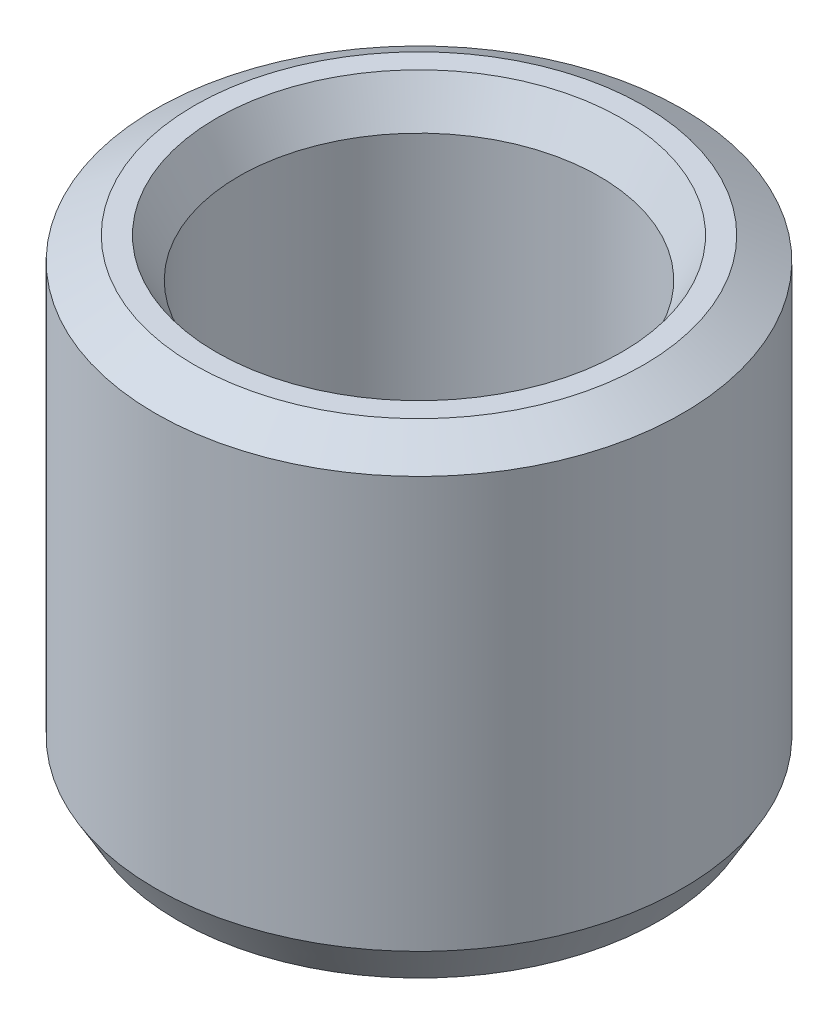
ISO-10303-21;
HEADER;
FILE_DESCRIPTION(('STEP AP214'),'2;1');
FILE_NAME('part.step','',(''),(''),'','','');
FILE_SCHEMA(('AUTOMOTIVE_DESIGN { 1 0 10303 214 1 1 1 1 }'));
ENDSEC;
DATA;
#1=APPLICATION_CONTEXT('core data for automotive mechanical design processes');
#2=APPLICATION_PROTOCOL_DEFINITION('international standard','automotive_design',2000,#1);
#3=PRODUCT_CONTEXT('',#1,'mechanical');
#4=PRODUCT('Part','Part','',(#3));
#5=PRODUCT_RELATED_PRODUCT_CATEGORY('part','',(#4));
#6=PRODUCT_DEFINITION_FORMATION('','',#4);
#7=PRODUCT_DEFINITION_CONTEXT('part definition',#1,'design');
#8=PRODUCT_DEFINITION('design','',#6,#7);
#9=PRODUCT_DEFINITION_SHAPE('','',#8);
#10=(LENGTH_UNIT() NAMED_UNIT(*) SI_UNIT(.MILLI.,.METRE.));
#11=(NAMED_UNIT(*) PLANE_ANGLE_UNIT() SI_UNIT($,.RADIAN.));
#12=(NAMED_UNIT(*) SI_UNIT($,.STERADIAN.) SOLID_ANGLE_UNIT());
#13=UNCERTAINTY_MEASURE_WITH_UNIT(LENGTH_MEASURE(1.E-05),#10,'distance_accuracy_value','');
#14=(GEOMETRIC_REPRESENTATION_CONTEXT(3) GLOBAL_UNCERTAINTY_ASSIGNED_CONTEXT((#13)) GLOBAL_UNIT_ASSIGNED_CONTEXT((#10,
#11,#12)) REPRESENTATION_CONTEXT('',''));
#15=CARTESIAN_POINT('',(0.,0.,0.));
#16=DIRECTION('',(0.,0.,1.));
#17=DIRECTION('',(1.,0.,0.));
#18=AXIS2_PLACEMENT_3D('',#15,#16,#17);
#19=CARTESIAN_POINT('',(0.,67.2547599984728,0.));
#20=DIRECTION('',(0.,-1.,0.));
#21=DIRECTION('',(0.,0.,-1.));
#22=AXIS2_PLACEMENT_3D('',#19,#20,#21);
#23=CYLINDRICAL_SURFACE('',#22,37.5);
#24=CARTESIAN_POINT('',(0.,5.54154210770039,0.));
#25=DIRECTION('',(0.,1.,0.));
#26=DIRECTION('',(0.,0.,1.));
#27=AXIS2_PLACEMENT_3D('',#24,#25,#26);
#28=CIRCLE('',#27,37.5);
#29=CARTESIAN_POINT('',(0.,5.54154210770039,37.5));
#30=VERTEX_POINT('',#29);
#31=EDGE_CURVE('E10',#30,#30,#28,.T.);
#32=ORIENTED_EDGE('',*,*,#31,.T.);
#33=EDGE_LOOP('',(#32));
#34=FACE_BOUND('',#33,.T.);
#35=CARTESIAN_POINT('',(0.,64.0553491708664,0.));
#36=DIRECTION('',(0.,1.,0.));
#37=DIRECTION('',(0.,0.,1.));
#38=AXIS2_PLACEMENT_3D('',#35,#36,#37);
#39=CIRCLE('',#38,37.5);
#40=CARTESIAN_POINT('',(0.,64.0553491708664,37.5));
#41=VERTEX_POINT('',#40);
#42=EDGE_CURVE('E50',#41,#41,#39,.F.);
#43=ORIENTED_EDGE('',*,*,#42,.T.);
#44=EDGE_LOOP('',(#43));
#45=FACE_BOUND('',#44,.T.);
#46=ADVANCED_FACE('F39',(#34,#45),#23,.T.);
#47=CARTESIAN_POINT('',(0.,67.2547599984728,0.));
#48=DIRECTION('',(0.,1.,0.));
#49=DIRECTION('',(0.,0.,1.));
#50=AXIS2_PLACEMENT_3D('',#47,#48,#49);
#51=PLANE('',#50);
#52=CARTESIAN_POINT('',(0.,67.2547599984728,0.));
#53=DIRECTION('',(0.,1.,0.));
#54=DIRECTION('',(0.,0.,1.));
#55=AXIS2_PLACEMENT_3D('',#52,#53,#54);
#56=CIRCLE('',#55,28.8254626167997);
#57=CARTESIAN_POINT('',(0.,67.2547599984728,28.8254626167997));
#58=VERTEX_POINT('',#57);
#59=EDGE_CURVE('E58',#58,#58,#56,.F.);
#60=ORIENTED_EDGE('',*,*,#59,.T.);
#61=EDGE_LOOP('',(#60));
#62=FACE_BOUND('',#61,.T.);
#63=CARTESIAN_POINT('',(0.,67.2547599984728,0.));
#64=DIRECTION('',(0.,1.,0.));
#65=DIRECTION('',(0.,0.,1.));
#66=AXIS2_PLACEMENT_3D('',#63,#64,#65);
#67=CIRCLE('',#66,31.9584578922996);
#68=CARTESIAN_POINT('',(0.,67.2547599984728,31.9584578922996));
#69=VERTEX_POINT('',#68);
#70=EDGE_CURVE('E61',#69,#69,#67,.T.);
#71=ORIENTED_EDGE('',*,*,#70,.T.);
#72=EDGE_LOOP('',(#71));
#73=FACE_BOUND('',#72,.T.);
#74=ADVANCED_FACE('F88',(#62,#73),#51,.T.);
#75=CARTESIAN_POINT('',(0.,0.,0.));
#76=DIRECTION('',(0.,1.,0.));
#77=DIRECTION('',(0.,0.,1.));
#78=AXIS2_PLACEMENT_3D('',#75,#76,#77);
#79=PLANE('',#78);
#80=CARTESIAN_POINT('',(0.,0.,0.));
#81=DIRECTION('',(0.,1.,0.));
#82=DIRECTION('',(0.,0.,1.));
#83=AXIS2_PLACEMENT_3D('',#80,#81,#82);
#84=CIRCLE('',#83,31.1675938968936);
#85=CARTESIAN_POINT('',(0.,0.,31.1675938968936));
#86=VERTEX_POINT('',#85);
#87=EDGE_CURVE('E51',#86,#86,#84,.T.);
#88=ORIENTED_EDGE('',*,*,#87,.T.);
#89=EDGE_LOOP('',(#88));
#90=FACE_BOUND('',#89,.T.);
#91=CARTESIAN_POINT('',(0.,0.,0.));
#92=DIRECTION('',(0.,1.,0.));
#93=DIRECTION('',(0.,0.,1.));
#94=AXIS2_PLACEMENT_3D('',#91,#92,#93);
#95=CIRCLE('',#94,34.3005891723935);
#96=CARTESIAN_POINT('',(0.,0.,34.3005891723935));
#97=VERTEX_POINT('',#96);
#98=EDGE_CURVE('E54',#97,#97,#95,.F.);
#99=ORIENTED_EDGE('',*,*,#98,.T.);
#100=EDGE_LOOP('',(#99));
#101=FACE_BOUND('',#100,.T.);
#102=ADVANCED_FACE('F83',(#90,#101),#79,.F.);
#103=CARTESIAN_POINT('',(0.,67.2547599984728,0.));
#104=DIRECTION('',(0.,-1.,0.));
#105=DIRECTION('',(0.,0.,-1.));
#106=AXIS2_PLACEMENT_3D('',#103,#104,#105);
#107=CYLINDRICAL_SURFACE('',#106,25.6260517891932);
#108=CARTESIAN_POINT('',(0.,61.7132178907724,0.));
#109=DIRECTION('',(0.,1.,0.));
#110=DIRECTION('',(0.,0.,1.));
#111=AXIS2_PLACEMENT_3D('',#108,#109,#110);
#112=CIRCLE('',#111,25.6260517891932);
#113=CARTESIAN_POINT('',(0.,61.7132178907724,25.6260517891932));
#114=VERTEX_POINT('',#113);
#115=EDGE_CURVE('E67',#114,#114,#112,.T.);
#116=ORIENTED_EDGE('',*,*,#115,.T.);
#117=EDGE_LOOP('',(#116));
#118=FACE_BOUND('',#117,.T.);
#119=CARTESIAN_POINT('',(0.,3.19941082760648,0.));
#120=DIRECTION('',(0.,1.,0.));
#121=DIRECTION('',(0.,0.,1.));
#122=AXIS2_PLACEMENT_3D('',#119,#120,#121);
#123=CIRCLE('',#122,25.6260517891932);
#124=CARTESIAN_POINT('',(0.,3.19941082760648,25.6260517891932));
#125=VERTEX_POINT('',#124);
#126=EDGE_CURVE('E69',#125,#125,#123,.F.);
#127=ORIENTED_EDGE('',*,*,#126,.T.);
#128=EDGE_LOOP('',(#127));
#129=FACE_BOUND('',#128,.T.);
#130=ADVANCED_FACE('F71',(#118,#129),#107,.F.);
#131=CARTESIAN_POINT('',(0.,61.7132178907724,0.));
#132=DIRECTION('',(0.,1.,0.));
#133=DIRECTION('',(0.,0.,1.));
#134=AXIS2_PLACEMENT_3D('',#131,#132,#133);
#135=CONICAL_SURFACE('',#134,25.6260517891932,0.523598775598303);
#136=ORIENTED_EDGE('',*,*,#59,.F.);
#137=EDGE_LOOP('',(#136));
#138=FACE_BOUND('',#137,.T.);
#139=ORIENTED_EDGE('',*,*,#115,.F.);
#140=EDGE_LOOP('',(#139));
#141=FACE_BOUND('',#140,.T.);
#142=ADVANCED_FACE('F77',(#138,#141),#135,.F.);
#143=CARTESIAN_POINT('',(0.,0.,0.));
#144=DIRECTION('',(0.,-1.,0.));
#145=DIRECTION('',(0.,0.,-1.));
#146=AXIS2_PLACEMENT_3D('',#143,#144,#145);
#147=CONICAL_SURFACE('',#146,31.1675938968936,1.04719755119659);
#148=ORIENTED_EDGE('',*,*,#126,.F.);
#149=EDGE_LOOP('',(#148));
#150=FACE_BOUND('',#149,.T.);
#151=ORIENTED_EDGE('',*,*,#87,.F.);
#152=EDGE_LOOP('',(#151));
#153=FACE_BOUND('',#152,.T.);
#154=ADVANCED_FACE('F73',(#150,#153),#147,.F.);
#155=CARTESIAN_POINT('',(0.,5.54154210770039,0.));
#156=DIRECTION('',(0.,1.,0.));
#157=DIRECTION('',(0.,0.,1.));
#158=AXIS2_PLACEMENT_3D('',#155,#156,#157);
#159=CONICAL_SURFACE('',#158,37.5,0.523598775598303);
#160=ORIENTED_EDGE('',*,*,#98,.F.);
#161=EDGE_LOOP('',(#160));
#162=FACE_BOUND('',#161,.T.);
#163=ORIENTED_EDGE('',*,*,#31,.F.);
#164=EDGE_LOOP('',(#163));
#165=FACE_BOUND('',#164,.T.);
#166=ADVANCED_FACE('F76',(#162,#165),#159,.T.);
#167=CARTESIAN_POINT('',(0.,67.2547599984728,0.));
#168=DIRECTION('',(0.,-1.,0.));
#169=DIRECTION('',(0.,0.,-1.));
#170=AXIS2_PLACEMENT_3D('',#167,#168,#169);
#171=CONICAL_SURFACE('',#170,31.9584578922996,1.04719755119659);
#172=ORIENTED_EDGE('',*,*,#42,.F.);
#173=EDGE_LOOP('',(#172));
#174=FACE_BOUND('',#173,.T.);
#175=ORIENTED_EDGE('',*,*,#70,.F.);
#176=EDGE_LOOP('',(#175));
#177=FACE_BOUND('',#176,.T.);
#178=ADVANCED_FACE('F45',(#174,#177),#171,.T.);
#179=CLOSED_SHELL('',(#46,#74,#102,#130,#142,#154,#166,#178));
#180=MANIFOLD_SOLID_BREP('B2',#179);
#181=ADVANCED_BREP_SHAPE_REPRESENTATION('',(#18,#180),#14);
#182=SHAPE_DEFINITION_REPRESENTATION(#9,#181);
ENDSEC;
END-ISO-10303-21;
